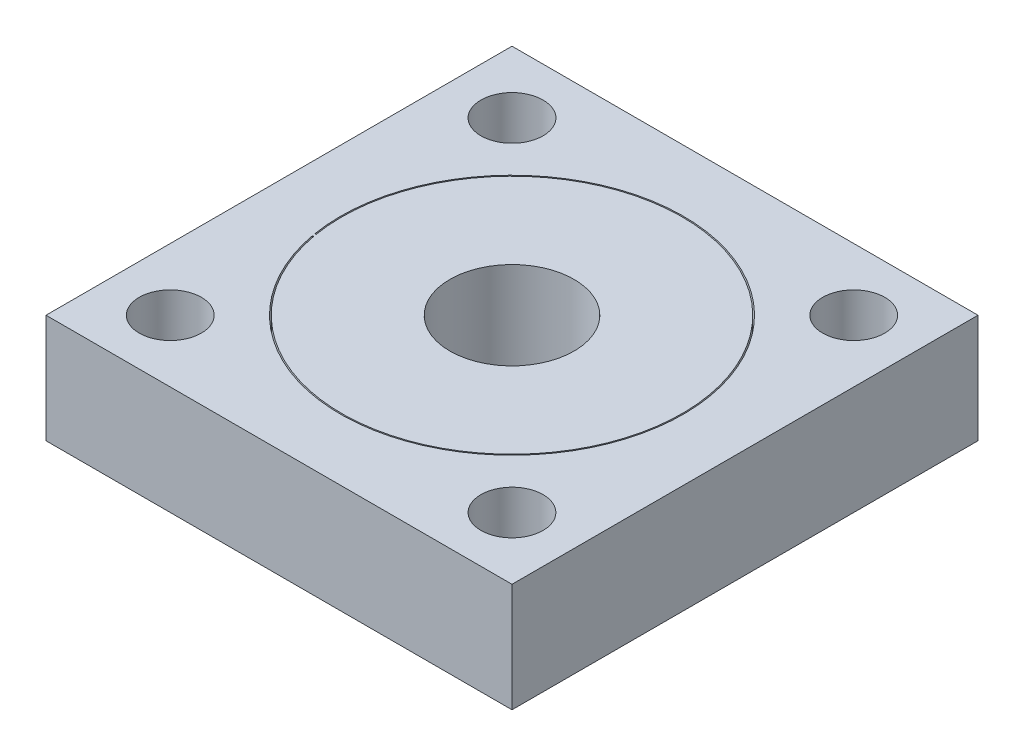
ISO-10303-21;
HEADER;
FILE_DESCRIPTION(('STEP AP214'),'2;1');
FILE_NAME('part.step','',(''),(''),'','','');
FILE_SCHEMA(('AUTOMOTIVE_DESIGN { 1 0 10303 214 1 1 1 1 }'));
ENDSEC;
DATA;
#1=APPLICATION_CONTEXT('core data for automotive mechanical design processes');
#2=APPLICATION_PROTOCOL_DEFINITION('international standard','automotive_design',2000,#1);
#3=PRODUCT_CONTEXT('',#1,'mechanical');
#4=PRODUCT('Part','Part','',(#3));
#5=PRODUCT_RELATED_PRODUCT_CATEGORY('part','',(#4));
#6=PRODUCT_DEFINITION_FORMATION('','',#4);
#7=PRODUCT_DEFINITION_CONTEXT('part definition',#1,'design');
#8=PRODUCT_DEFINITION('design','',#6,#7);
#9=PRODUCT_DEFINITION_SHAPE('','',#8);
#10=(LENGTH_UNIT() NAMED_UNIT(*) SI_UNIT(.MILLI.,.METRE.));
#11=(NAMED_UNIT(*) PLANE_ANGLE_UNIT() SI_UNIT($,.RADIAN.));
#12=(NAMED_UNIT(*) SI_UNIT($,.STERADIAN.) SOLID_ANGLE_UNIT());
#13=UNCERTAINTY_MEASURE_WITH_UNIT(LENGTH_MEASURE(1.E-05),#10,'distance_accuracy_value','');
#14=(GEOMETRIC_REPRESENTATION_CONTEXT(3) GLOBAL_UNCERTAINTY_ASSIGNED_CONTEXT((#13)) GLOBAL_UNIT_ASSIGNED_CONTEXT((#10,
#11,#12)) REPRESENTATION_CONTEXT('',''));
#15=CARTESIAN_POINT('',(0.,0.,0.));
#16=DIRECTION('',(0.,0.,1.));
#17=DIRECTION('',(1.,0.,0.));
#18=AXIS2_PLACEMENT_3D('',#15,#16,#17);
#19=CARTESIAN_POINT('',(15.,7.,0.));
#20=DIRECTION('',(1.,0.,0.));
#21=DIRECTION('',(0.,0.,-1.));
#22=AXIS2_PLACEMENT_3D('',#19,#20,#21);
#23=PLANE('',#22);
#24=DIRECTION('',(0.,0.,1.));
#25=VECTOR('',#24,1.);
#26=CARTESIAN_POINT('',(15.,0.,0.));
#27=LINE('',#26,#25);
#28=CARTESIAN_POINT('',(15.,0.,-15.));
#29=VERTEX_POINT('',#28);
#30=CARTESIAN_POINT('',(15.,0.,15.));
#31=VERTEX_POINT('',#30);
#32=EDGE_CURVE('E120',#29,#31,#27,.T.);
#33=ORIENTED_EDGE('',*,*,#32,.F.);
#34=DIRECTION('',(0.,-1.,0.));
#35=VECTOR('',#34,1.);
#36=CARTESIAN_POINT('',(15.,7.,-15.));
#37=LINE('',#36,#35);
#38=CARTESIAN_POINT('',(15.,7.,-15.));
#39=VERTEX_POINT('',#38);
#40=EDGE_CURVE('E157',#39,#29,#37,.T.);
#41=ORIENTED_EDGE('',*,*,#40,.F.);
#42=DIRECTION('',(0.,0.,1.));
#43=VECTOR('',#42,1.);
#44=CARTESIAN_POINT('',(15.,7.,0.));
#45=LINE('',#44,#43);
#46=CARTESIAN_POINT('',(15.,7.,15.));
#47=VERTEX_POINT('',#46);
#48=EDGE_CURVE('E123',#39,#47,#45,.T.);
#49=ORIENTED_EDGE('',*,*,#48,.T.);
#50=DIRECTION('',(0.,-1.,0.));
#51=VECTOR('',#50,1.);
#52=CARTESIAN_POINT('',(15.,7.,15.));
#53=LINE('',#52,#51);
#54=EDGE_CURVE('E119',#47,#31,#53,.T.);
#55=ORIENTED_EDGE('',*,*,#54,.T.);
#56=EDGE_LOOP('',(#33,#41,#49,#55));
#57=FACE_BOUND('',#56,.T.);
#58=ADVANCED_FACE('F40',(#57),#23,.T.);
#59=CARTESIAN_POINT('',(0.,7.,-15.));
#60=DIRECTION('',(0.,0.,-1.));
#61=DIRECTION('',(-1.,0.,0.));
#62=AXIS2_PLACEMENT_3D('',#59,#60,#61);
#63=PLANE('',#62);
#64=DIRECTION('',(1.,0.,0.));
#65=VECTOR('',#64,1.);
#66=CARTESIAN_POINT('',(0.,0.,-15.));
#67=LINE('',#66,#65);
#68=CARTESIAN_POINT('',(-15.,0.,-15.));
#69=VERTEX_POINT('',#68);
#70=EDGE_CURVE('E138',#69,#29,#67,.T.);
#71=ORIENTED_EDGE('',*,*,#70,.F.);
#72=DIRECTION('',(0.,-1.,0.));
#73=VECTOR('',#72,1.);
#74=CARTESIAN_POINT('',(-15.,7.,-15.));
#75=LINE('',#74,#73);
#76=CARTESIAN_POINT('',(-15.,7.,-15.));
#77=VERTEX_POINT('',#76);
#78=EDGE_CURVE('E154',#77,#69,#75,.T.);
#79=ORIENTED_EDGE('',*,*,#78,.F.);
#80=DIRECTION('',(1.,0.,0.));
#81=VECTOR('',#80,1.);
#82=CARTESIAN_POINT('',(0.,7.,-15.));
#83=LINE('',#82,#81);
#84=EDGE_CURVE('E224',#77,#39,#83,.T.);
#85=ORIENTED_EDGE('',*,*,#84,.T.);
#86=ORIENTED_EDGE('',*,*,#40,.T.);
#87=EDGE_LOOP('',(#71,#79,#85,#86));
#88=FACE_BOUND('',#87,.T.);
#89=ADVANCED_FACE('F239',(#88),#63,.T.);
#90=CARTESIAN_POINT('',(-15.,7.,0.));
#91=DIRECTION('',(1.,0.,0.));
#92=DIRECTION('',(0.,0.,-1.));
#93=AXIS2_PLACEMENT_3D('',#90,#91,#92);
#94=PLANE('',#93);
#95=DIRECTION('',(0.,0.,1.));
#96=VECTOR('',#95,1.);
#97=CARTESIAN_POINT('',(-15.,0.,0.));
#98=LINE('',#97,#96);
#99=CARTESIAN_POINT('',(-15.,0.,15.));
#100=VERTEX_POINT('',#99);
#101=EDGE_CURVE('E134',#69,#100,#98,.T.);
#102=ORIENTED_EDGE('',*,*,#101,.T.);
#103=DIRECTION('',(0.,-1.,0.));
#104=VECTOR('',#103,1.);
#105=CARTESIAN_POINT('',(-15.,7.,15.));
#106=LINE('',#105,#104);
#107=CARTESIAN_POINT('',(-15.,7.,15.));
#108=VERTEX_POINT('',#107);
#109=EDGE_CURVE('E126',#108,#100,#106,.T.);
#110=ORIENTED_EDGE('',*,*,#109,.F.);
#111=DIRECTION('',(0.,0.,1.));
#112=VECTOR('',#111,1.);
#113=CARTESIAN_POINT('',(-15.,7.,0.));
#114=LINE('',#113,#112);
#115=EDGE_CURVE('E228',#77,#108,#114,.T.);
#116=ORIENTED_EDGE('',*,*,#115,.F.);
#117=ORIENTED_EDGE('',*,*,#78,.T.);
#118=EDGE_LOOP('',(#102,#110,#116,#117));
#119=FACE_BOUND('',#118,.T.);
#120=ADVANCED_FACE('F237',(#119),#94,.F.);
#121=CARTESIAN_POINT('',(0.,7.,0.));
#122=DIRECTION('',(0.,-1.,0.));
#123=DIRECTION('',(0.,0.,-1.));
#124=AXIS2_PLACEMENT_3D('',#121,#122,#123);
#125=CYLINDRICAL_SURFACE('',#124,4.);
#126=CARTESIAN_POINT('',(0.,7.,0.));
#127=DIRECTION('',(0.,1.,0.));
#128=DIRECTION('',(0.,0.,1.));
#129=AXIS2_PLACEMENT_3D('',#126,#127,#128);
#130=CIRCLE('',#129,4.);
#131=CARTESIAN_POINT('',(0.,7.,4.));
#132=VERTEX_POINT('',#131);
#133=EDGE_CURVE('E133',#132,#132,#130,.T.);
#134=ORIENTED_EDGE('',*,*,#133,.T.);
#135=EDGE_LOOP('',(#134));
#136=FACE_BOUND('',#135,.T.);
#137=CARTESIAN_POINT('',(0.,0.,0.));
#138=DIRECTION('',(0.,1.,0.));
#139=DIRECTION('',(0.,0.,1.));
#140=AXIS2_PLACEMENT_3D('',#137,#138,#139);
#141=CIRCLE('',#140,4.);
#142=CARTESIAN_POINT('',(0.,0.,4.));
#143=VERTEX_POINT('',#142);
#144=EDGE_CURVE('E140',#143,#143,#141,.T.);
#145=ORIENTED_EDGE('',*,*,#144,.F.);
#146=EDGE_LOOP('',(#145));
#147=FACE_BOUND('',#146,.T.);
#148=ADVANCED_FACE('F42',(#136,#147),#125,.F.);
#149=CARTESIAN_POINT('',(0.,7.,15.));
#150=DIRECTION('',(0.,0.,-1.));
#151=DIRECTION('',(-1.,0.,0.));
#152=AXIS2_PLACEMENT_3D('',#149,#150,#151);
#153=PLANE('',#152);
#154=DIRECTION('',(1.,0.,0.));
#155=VECTOR('',#154,1.);
#156=CARTESIAN_POINT('',(0.,0.,15.));
#157=LINE('',#156,#155);
#158=EDGE_CURVE('E112',#100,#31,#157,.T.);
#159=ORIENTED_EDGE('',*,*,#158,.T.);
#160=ORIENTED_EDGE('',*,*,#54,.F.);
#161=DIRECTION('',(1.,0.,0.));
#162=VECTOR('',#161,1.);
#163=CARTESIAN_POINT('',(0.,7.,15.));
#164=LINE('',#163,#162);
#165=EDGE_CURVE('E127',#108,#47,#164,.T.);
#166=ORIENTED_EDGE('',*,*,#165,.F.);
#167=ORIENTED_EDGE('',*,*,#109,.T.);
#168=EDGE_LOOP('',(#159,#160,#166,#167));
#169=FACE_BOUND('',#168,.T.);
#170=ADVANCED_FACE('F129',(#169),#153,.F.);
#171=CARTESIAN_POINT('',(0.,7.,0.));
#172=DIRECTION('',(0.,1.,0.));
#173=DIRECTION('',(0.,0.,1.));
#174=AXIS2_PLACEMENT_3D('',#171,#172,#173);
#175=PLANE('',#174);
#176=CARTESIAN_POINT('',(-11.,7.,-11.));
#177=DIRECTION('',(0.,1.,0.));
#178=DIRECTION('',(1.,0.,0.));
#179=AXIS2_PLACEMENT_3D('',#176,#177,#178);
#180=CIRCLE('',#179,2.);
#181=CARTESIAN_POINT('',(-9.00000000000004,7.,-11.));
#182=VERTEX_POINT('',#181);
#183=EDGE_CURVE('E178',#182,#182,#180,.T.);
#184=ORIENTED_EDGE('',*,*,#183,.F.);
#185=EDGE_LOOP('',(#184));
#186=FACE_BOUND('',#185,.T.);
#187=CARTESIAN_POINT('',(-11.,7.,11.));
#188=DIRECTION('',(0.,1.,0.));
#189=DIRECTION('',(0.,0.,-1.));
#190=AXIS2_PLACEMENT_3D('',#187,#188,#189);
#191=CIRCLE('',#190,2.);
#192=CARTESIAN_POINT('',(-11.,7.,9.));
#193=VERTEX_POINT('',#192);
#194=EDGE_CURVE('E288',#193,#193,#191,.T.);
#195=ORIENTED_EDGE('',*,*,#194,.F.);
#196=EDGE_LOOP('',(#195));
#197=FACE_BOUND('',#196,.T.);
#198=CARTESIAN_POINT('',(11.0000000000001,7.,10.9999999999999));
#199=DIRECTION('',(0.,1.,0.));
#200=DIRECTION('',(-1.,0.,0.));
#201=AXIS2_PLACEMENT_3D('',#198,#199,#200);
#202=CIRCLE('',#201,2.);
#203=CARTESIAN_POINT('',(9.00000000000011,7.,10.9999999999999));
#204=VERTEX_POINT('',#203);
#205=EDGE_CURVE('E194',#204,#204,#202,.T.);
#206=ORIENTED_EDGE('',*,*,#205,.F.);
#207=EDGE_LOOP('',(#206));
#208=FACE_BOUND('',#207,.T.);
#209=CARTESIAN_POINT('',(11.,7.,-11.));
#210=DIRECTION('',(0.,1.,0.));
#211=DIRECTION('',(0.,0.,1.));
#212=AXIS2_PLACEMENT_3D('',#209,#210,#211);
#213=CIRCLE('',#212,2.);
#214=CARTESIAN_POINT('',(11.,7.,-9.));
#215=VERTEX_POINT('',#214);
#216=EDGE_CURVE('E173',#215,#215,#213,.T.);
#217=ORIENTED_EDGE('',*,*,#216,.F.);
#218=EDGE_LOOP('',(#217));
#219=FACE_BOUND('',#218,.T.);
#220=CARTESIAN_POINT('',(0.,7.,0.));
#221=DIRECTION('',(0.,1.,0.));
#222=DIRECTION('',(0.,0.,1.));
#223=AXIS2_PLACEMENT_3D('',#220,#221,#222);
#224=CIRCLE('',#223,11.04);
#225=CARTESIAN_POINT('',(-10.8582010170005,7.,1.99526205657554));
#226=VERTEX_POINT('',#225);
#227=CARTESIAN_POINT('',(-10.8913693847529,7.,1.80545643117365));
#228=VERTEX_POINT('',#227);
#229=EDGE_CURVE('E146',#226,#228,#224,.T.);
#230=ORIENTED_EDGE('',*,*,#229,.F.);
#231=DIRECTION('',(0.98353270081526,0.,-0.180730258747784));
#232=VECTOR('',#231,1.);
#233=CARTESIAN_POINT('',(0.,7.,0.));
#234=LINE('',#233,#232);
#235=CARTESIAN_POINT('',(-10.7795184009352,7.,1.98080363587571));
#236=VERTEX_POINT('',#235);
#237=EDGE_CURVE('E205',#226,#236,#234,.T.);
#238=ORIENTED_EDGE('',*,*,#237,.T.);
#239=CARTESIAN_POINT('',(0.,7.,0.));
#240=DIRECTION('',(0.,1.,0.));
#241=DIRECTION('',(0.,0.,1.));
#242=AXIS2_PLACEMENT_3D('',#239,#240,#241);
#243=CIRCLE('',#242,10.96);
#244=CARTESIAN_POINT('',(-10.8124464181968,7.,1.79237341355645));
#245=VERTEX_POINT('',#244);
#246=EDGE_CURVE('E211',#236,#245,#243,.T.);
#247=ORIENTED_EDGE('',*,*,#246,.T.);
#248=DIRECTION('',(-0.986537081952259,0.,0.163537720215006));
#249=VECTOR('',#248,1.);
#250=CARTESIAN_POINT('',(0.,7.,0.));
#251=LINE('',#250,#249);
#252=EDGE_CURVE('E87',#245,#228,#251,.T.);
#253=ORIENTED_EDGE('',*,*,#252,.T.);
#254=EDGE_LOOP('',(#230,#238,#247,#253));
#255=FACE_BOUND('',#254,.T.);
#256=ORIENTED_EDGE('',*,*,#133,.F.);
#257=EDGE_LOOP('',(#256));
#258=FACE_BOUND('',#257,.T.);
#259=ORIENTED_EDGE('',*,*,#48,.F.);
#260=ORIENTED_EDGE('',*,*,#84,.F.);
#261=ORIENTED_EDGE('',*,*,#115,.T.);
#262=ORIENTED_EDGE('',*,*,#165,.T.);
#263=EDGE_LOOP('',(#259,#260,#261,#262));
#264=FACE_BOUND('',#263,.T.);
#265=ADVANCED_FACE('F233',(#186,#197,#208,#219,#255,#258,#264),#175,.T.);
#266=CARTESIAN_POINT('',(0.,0.,0.));
#267=DIRECTION('',(0.,1.,0.));
#268=DIRECTION('',(0.,0.,1.));
#269=AXIS2_PLACEMENT_3D('',#266,#267,#268);
#270=PLANE('',#269);
#271=CARTESIAN_POINT('',(-11.,0.,-11.));
#272=DIRECTION('',(0.,1.,0.));
#273=DIRECTION('',(0.,0.,1.));
#274=AXIS2_PLACEMENT_3D('',#271,#272,#273);
#275=CIRCLE('',#274,2.);
#276=CARTESIAN_POINT('',(-11.,0.,-8.99999999999996));
#277=VERTEX_POINT('',#276);
#278=EDGE_CURVE('E44',#277,#277,#275,.T.);
#279=ORIENTED_EDGE('',*,*,#278,.T.);
#280=EDGE_LOOP('',(#279));
#281=FACE_BOUND('',#280,.T.);
#282=CARTESIAN_POINT('',(-11.,0.,11.));
#283=DIRECTION('',(0.,1.,0.));
#284=DIRECTION('',(0.,0.,1.));
#285=AXIS2_PLACEMENT_3D('',#282,#283,#284);
#286=CIRCLE('',#285,2.);
#287=CARTESIAN_POINT('',(-11.,0.,13.));
#288=VERTEX_POINT('',#287);
#289=EDGE_CURVE('E177',#288,#288,#286,.T.);
#290=ORIENTED_EDGE('',*,*,#289,.T.);
#291=EDGE_LOOP('',(#290));
#292=FACE_BOUND('',#291,.T.);
#293=CARTESIAN_POINT('',(11.0000000000001,0.,10.9999999999999));
#294=DIRECTION('',(0.,1.,0.));
#295=DIRECTION('',(0.,0.,1.));
#296=AXIS2_PLACEMENT_3D('',#293,#294,#295);
#297=CIRCLE('',#296,2.);
#298=CARTESIAN_POINT('',(11.0000000000001,0.,12.9999999999999));
#299=VERTEX_POINT('',#298);
#300=EDGE_CURVE('E174',#299,#299,#297,.T.);
#301=ORIENTED_EDGE('',*,*,#300,.T.);
#302=EDGE_LOOP('',(#301));
#303=FACE_BOUND('',#302,.T.);
#304=CARTESIAN_POINT('',(11.,0.,-11.));
#305=DIRECTION('',(0.,1.,0.));
#306=DIRECTION('',(0.,0.,1.));
#307=AXIS2_PLACEMENT_3D('',#304,#305,#306);
#308=CIRCLE('',#307,2.);
#309=CARTESIAN_POINT('',(11.,0.,-9.));
#310=VERTEX_POINT('',#309);
#311=EDGE_CURVE('E168',#310,#310,#308,.T.);
#312=ORIENTED_EDGE('',*,*,#311,.T.);
#313=EDGE_LOOP('',(#312));
#314=FACE_BOUND('',#313,.T.);
#315=DIRECTION('',(0.98353270081526,0.,-0.180730258747784));
#316=VECTOR('',#315,1.);
#317=CARTESIAN_POINT('',(-10.7795184009352,0.,1.98080363587571));
#318=LINE('',#317,#316);
#319=CARTESIAN_POINT('',(-10.8582010170005,0.,1.99526205657554));
#320=VERTEX_POINT('',#319);
#321=CARTESIAN_POINT('',(-10.7795184009352,0.,1.98080363587571));
#322=VERTEX_POINT('',#321);
#323=EDGE_CURVE('E160',#320,#322,#318,.T.);
#324=ORIENTED_EDGE('',*,*,#323,.F.);
#325=CARTESIAN_POINT('',(0.,0.,0.));
#326=DIRECTION('',(0.,-1.,0.));
#327=DIRECTION('',(0.,0.,-1.));
#328=AXIS2_PLACEMENT_3D('',#325,#326,#327);
#329=CIRCLE('',#328,11.04);
#330=CARTESIAN_POINT('',(-10.8913693847529,0.,1.80545643117365));
#331=VERTEX_POINT('',#330);
#332=EDGE_CURVE('E11',#320,#331,#329,.F.);
#333=ORIENTED_EDGE('',*,*,#332,.T.);
#334=DIRECTION('',(-0.986537081952259,0.,0.163537720215006));
#335=VECTOR('',#334,1.);
#336=CARTESIAN_POINT('',(-10.8913693847529,0.,1.80545643117365));
#337=LINE('',#336,#335);
#338=CARTESIAN_POINT('',(-10.8124464181968,0.,1.79237341355645));
#339=VERTEX_POINT('',#338);
#340=EDGE_CURVE('E51',#339,#331,#337,.T.);
#341=ORIENTED_EDGE('',*,*,#340,.F.);
#342=CARTESIAN_POINT('',(0.,0.,0.));
#343=DIRECTION('',(0.,-1.,0.));
#344=DIRECTION('',(0.,0.,-1.));
#345=AXIS2_PLACEMENT_3D('',#342,#343,#344);
#346=CIRCLE('',#345,10.96);
#347=EDGE_CURVE('E78',#322,#339,#346,.F.);
#348=ORIENTED_EDGE('',*,*,#347,.F.);
#349=EDGE_LOOP('',(#324,#333,#341,#348));
#350=FACE_BOUND('',#349,.T.);
#351=ORIENTED_EDGE('',*,*,#144,.T.);
#352=EDGE_LOOP('',(#351));
#353=FACE_BOUND('',#352,.T.);
#354=ORIENTED_EDGE('',*,*,#32,.T.);
#355=ORIENTED_EDGE('',*,*,#158,.F.);
#356=ORIENTED_EDGE('',*,*,#101,.F.);
#357=ORIENTED_EDGE('',*,*,#70,.T.);
#358=EDGE_LOOP('',(#354,#355,#356,#357));
#359=FACE_BOUND('',#358,.T.);
#360=ADVANCED_FACE('F136',(#281,#292,#303,#314,#350,#353,#359),#270,.F.);
#361=CARTESIAN_POINT('',(0.,10.,0.));
#362=DIRECTION('',(0.,-1.,0.));
#363=DIRECTION('',(0.,0.,-1.));
#364=AXIS2_PLACEMENT_3D('',#361,#362,#363);
#365=CYLINDRICAL_SURFACE('',#364,11.04);
#366=ORIENTED_EDGE('',*,*,#229,.T.);
#367=DIRECTION('',(0.,-1.,0.));
#368=VECTOR('',#367,1.);
#369=CARTESIAN_POINT('',(-10.8913693847529,10.,1.80545643117365));
#370=LINE('',#369,#368);
#371=EDGE_CURVE('E201',#228,#331,#370,.T.);
#372=ORIENTED_EDGE('',*,*,#371,.T.);
#373=ORIENTED_EDGE('',*,*,#332,.F.);
#374=DIRECTION('',(0.,-1.,0.));
#375=VECTOR('',#374,1.);
#376=CARTESIAN_POINT('',(-10.8582010170005,10.,1.99526205657554));
#377=LINE('',#376,#375);
#378=EDGE_CURVE('E172',#226,#320,#377,.T.);
#379=ORIENTED_EDGE('',*,*,#378,.F.);
#380=EDGE_LOOP('',(#366,#372,#373,#379));
#381=FACE_BOUND('',#380,.T.);
#382=ADVANCED_FACE('F252',(#381),#365,.F.);
#383=CARTESIAN_POINT('',(-10.8913693847529,10.,1.80545643117365));
#384=DIRECTION('',(-0.163537720215006,0.,-0.986537081952259));
#385=DIRECTION('',(-0.986537081952259,0.,0.163537720215006));
#386=AXIS2_PLACEMENT_3D('',#383,#384,#385);
#387=PLANE('',#386);
#388=DIRECTION('',(0.,-1.,0.));
#389=VECTOR('',#388,1.);
#390=CARTESIAN_POINT('',(-10.8124464181968,10.,1.79237341355645));
#391=LINE('',#390,#389);
#392=EDGE_CURVE('E198',#245,#339,#391,.T.);
#393=ORIENTED_EDGE('',*,*,#392,.T.);
#394=ORIENTED_EDGE('',*,*,#340,.T.);
#395=ORIENTED_EDGE('',*,*,#371,.F.);
#396=ORIENTED_EDGE('',*,*,#252,.F.);
#397=EDGE_LOOP('',(#393,#394,#395,#396));
#398=FACE_BOUND('',#397,.T.);
#399=ADVANCED_FACE('F258',(#398),#387,.T.);
#400=CARTESIAN_POINT('',(0.,10.,0.));
#401=DIRECTION('',(0.,-1.,0.));
#402=DIRECTION('',(0.,0.,-1.));
#403=AXIS2_PLACEMENT_3D('',#400,#401,#402);
#404=CYLINDRICAL_SURFACE('',#403,10.96);
#405=DIRECTION('',(0.,-1.,0.));
#406=VECTOR('',#405,1.);
#407=CARTESIAN_POINT('',(-10.7795184009352,10.,1.98080363587571));
#408=LINE('',#407,#406);
#409=EDGE_CURVE('E60',#236,#322,#408,.T.);
#410=ORIENTED_EDGE('',*,*,#409,.T.);
#411=ORIENTED_EDGE('',*,*,#347,.T.);
#412=ORIENTED_EDGE('',*,*,#392,.F.);
#413=ORIENTED_EDGE('',*,*,#246,.F.);
#414=EDGE_LOOP('',(#410,#411,#412,#413));
#415=FACE_BOUND('',#414,.T.);
#416=ADVANCED_FACE('F264',(#415),#404,.T.);
#417=CARTESIAN_POINT('',(-10.7795184009352,10.,1.98080363587571));
#418=DIRECTION('',(0.180730258747784,0.,0.98353270081526));
#419=DIRECTION('',(0.98353270081526,0.,-0.180730258747784));
#420=AXIS2_PLACEMENT_3D('',#417,#418,#419);
#421=PLANE('',#420);
#422=ORIENTED_EDGE('',*,*,#378,.T.);
#423=ORIENTED_EDGE('',*,*,#323,.T.);
#424=ORIENTED_EDGE('',*,*,#409,.F.);
#425=ORIENTED_EDGE('',*,*,#237,.F.);
#426=EDGE_LOOP('',(#422,#423,#424,#425));
#427=FACE_BOUND('',#426,.T.);
#428=ADVANCED_FACE('F260',(#427),#421,.T.);
#429=CARTESIAN_POINT('',(11.,-3.,-11.));
#430=DIRECTION('',(0.,1.,0.));
#431=DIRECTION('',(0.,0.,1.));
#432=AXIS2_PLACEMENT_3D('',#429,#430,#431);
#433=CYLINDRICAL_SURFACE('',#432,2.);
#434=ORIENTED_EDGE('',*,*,#216,.T.);
#435=EDGE_LOOP('',(#434));
#436=FACE_BOUND('',#435,.T.);
#437=ORIENTED_EDGE('',*,*,#311,.F.);
#438=EDGE_LOOP('',(#437));
#439=FACE_BOUND('',#438,.T.);
#440=ADVANCED_FACE('F263',(#436,#439),#433,.F.);
#441=CARTESIAN_POINT('',(11.0000000000001,-3.,10.9999999999999));
#442=DIRECTION('',(0.,1.,0.));
#443=DIRECTION('',(0.,0.,1.));
#444=AXIS2_PLACEMENT_3D('',#441,#442,#443);
#445=CYLINDRICAL_SURFACE('',#444,2.);
#446=ORIENTED_EDGE('',*,*,#205,.T.);
#447=EDGE_LOOP('',(#446));
#448=FACE_BOUND('',#447,.T.);
#449=ORIENTED_EDGE('',*,*,#300,.F.);
#450=EDGE_LOOP('',(#449));
#451=FACE_BOUND('',#450,.T.);
#452=ADVANCED_FACE('F271',(#448,#451),#445,.F.);
#453=CARTESIAN_POINT('',(-11.,-3.,11.));
#454=DIRECTION('',(0.,1.,0.));
#455=DIRECTION('',(0.,0.,1.));
#456=AXIS2_PLACEMENT_3D('',#453,#454,#455);
#457=CYLINDRICAL_SURFACE('',#456,2.);
#458=ORIENTED_EDGE('',*,*,#194,.T.);
#459=EDGE_LOOP('',(#458));
#460=FACE_BOUND('',#459,.T.);
#461=ORIENTED_EDGE('',*,*,#289,.F.);
#462=EDGE_LOOP('',(#461));
#463=FACE_BOUND('',#462,.T.);
#464=ADVANCED_FACE('F274',(#460,#463),#457,.F.);
#465=CARTESIAN_POINT('',(-11.,-3.,-11.));
#466=DIRECTION('',(0.,1.,0.));
#467=DIRECTION('',(0.,0.,1.));
#468=AXIS2_PLACEMENT_3D('',#465,#466,#467);
#469=CYLINDRICAL_SURFACE('',#468,2.);
#470=ORIENTED_EDGE('',*,*,#183,.T.);
#471=EDGE_LOOP('',(#470));
#472=FACE_BOUND('',#471,.T.);
#473=ORIENTED_EDGE('',*,*,#278,.F.);
#474=EDGE_LOOP('',(#473));
#475=FACE_BOUND('',#474,.T.);
#476=ADVANCED_FACE('F278',(#472,#475),#469,.F.);
#477=CLOSED_SHELL('',(#58,#89,#120,#148,#170,#265,#360,#382,#399,#416,#428,#440,#452,#464,#476));
#478=MANIFOLD_SOLID_BREP('B2',#477);
#479=ADVANCED_BREP_SHAPE_REPRESENTATION('',(#18,#478),#14);
#480=SHAPE_DEFINITION_REPRESENTATION(#9,#479);
ENDSEC;
END-ISO-10303-21;
